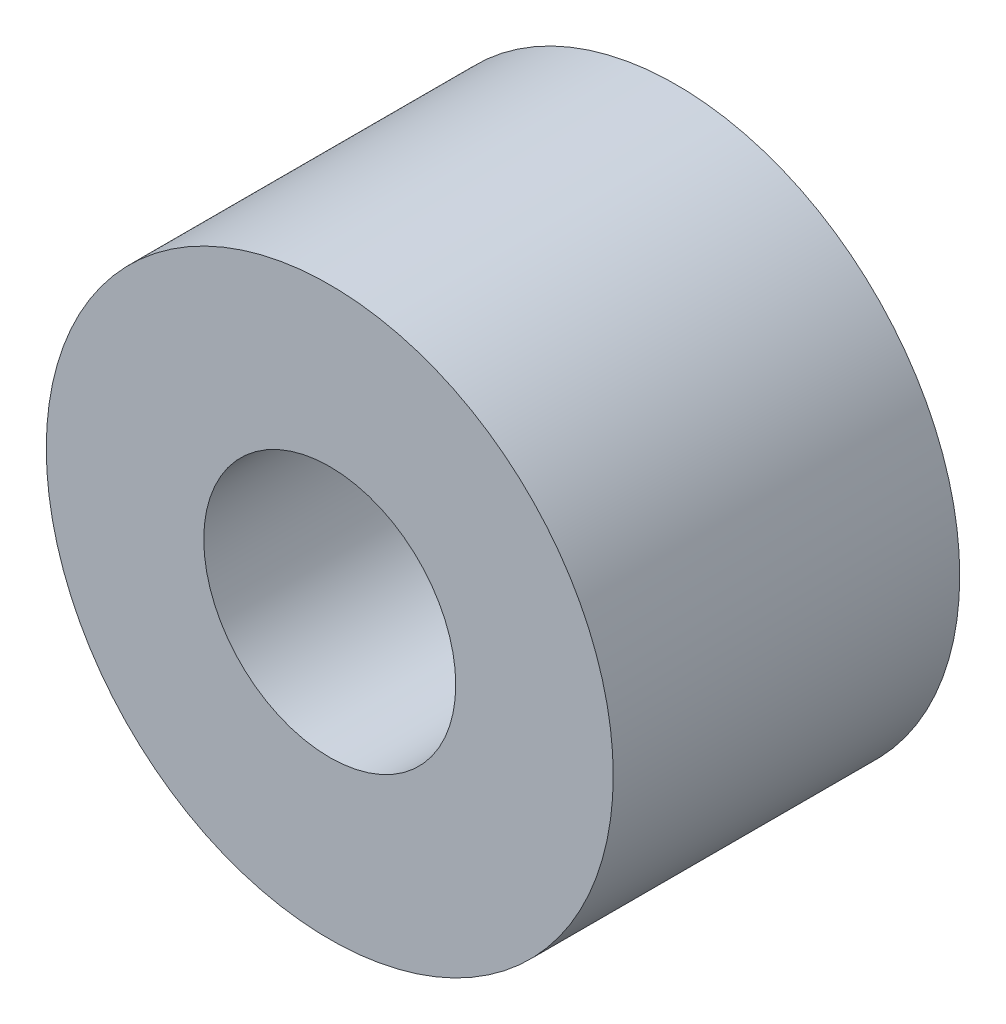
ISO-10303-21;
HEADER;
FILE_DESCRIPTION(('STEP AP214'),'2;1');
FILE_NAME('part.step','',(''),(''),'','','');
FILE_SCHEMA(('AUTOMOTIVE_DESIGN { 1 0 10303 214 1 1 1 1 }'));
ENDSEC;
DATA;
#1=APPLICATION_CONTEXT('core data for automotive mechanical design processes');
#2=APPLICATION_PROTOCOL_DEFINITION('international standard','automotive_design',2000,#1);
#3=PRODUCT_CONTEXT('',#1,'mechanical');
#4=PRODUCT('Part','Part','',(#3));
#5=PRODUCT_RELATED_PRODUCT_CATEGORY('part','',(#4));
#6=PRODUCT_DEFINITION_FORMATION('','',#4);
#7=PRODUCT_DEFINITION_CONTEXT('part definition',#1,'design');
#8=PRODUCT_DEFINITION('design','',#6,#7);
#9=PRODUCT_DEFINITION_SHAPE('','',#8);
#10=(LENGTH_UNIT() NAMED_UNIT(*) SI_UNIT(.MILLI.,.METRE.));
#11=(NAMED_UNIT(*) PLANE_ANGLE_UNIT() SI_UNIT($,.RADIAN.));
#12=(NAMED_UNIT(*) SI_UNIT($,.STERADIAN.) SOLID_ANGLE_UNIT());
#13=UNCERTAINTY_MEASURE_WITH_UNIT(LENGTH_MEASURE(1.E-05),#10,'distance_accuracy_value','');
#14=(GEOMETRIC_REPRESENTATION_CONTEXT(3) GLOBAL_UNCERTAINTY_ASSIGNED_CONTEXT((#13)) GLOBAL_UNIT_ASSIGNED_CONTEXT((#10,
#11,#12)) REPRESENTATION_CONTEXT('',''));
#15=CARTESIAN_POINT('',(0.,0.,0.));
#16=DIRECTION('',(0.,0.,1.));
#17=DIRECTION('',(1.,0.,0.));
#18=AXIS2_PLACEMENT_3D('',#15,#16,#17);
#19=CARTESIAN_POINT('',(0.,0.,5.5));
#20=DIRECTION('',(0.,0.,1.));
#21=DIRECTION('',(1.,0.,0.));
#22=AXIS2_PLACEMENT_3D('',#19,#20,#21);
#23=PLANE('',#22);
#24=CARTESIAN_POINT('',(0.,0.,5.5));
#25=DIRECTION('',(0.,0.,1.));
#26=DIRECTION('',(1.,0.,0.));
#27=AXIS2_PLACEMENT_3D('',#24,#25,#26);
#28=CIRCLE('',#27,4.5);
#29=CARTESIAN_POINT('',(4.5,0.,5.5));
#30=VERTEX_POINT('',#29);
#31=EDGE_CURVE('E10',#30,#30,#28,.T.);
#32=ORIENTED_EDGE('',*,*,#31,.T.);
#33=EDGE_LOOP('',(#32));
#34=FACE_BOUND('',#33,.T.);
#35=CARTESIAN_POINT('',(0.,0.,5.5));
#36=DIRECTION('',(0.,0.,1.));
#37=DIRECTION('',(1.,0.,0.));
#38=AXIS2_PLACEMENT_3D('',#35,#36,#37);
#39=CIRCLE('',#38,2.);
#40=CARTESIAN_POINT('',(2.,0.,5.5));
#41=VERTEX_POINT('',#40);
#42=EDGE_CURVE('E50',#41,#41,#39,.T.);
#43=ORIENTED_EDGE('',*,*,#42,.F.);
#44=EDGE_LOOP('',(#43));
#45=FACE_BOUND('',#44,.T.);
#46=ADVANCED_FACE('F37',(#34,#45),#23,.T.);
#47=CARTESIAN_POINT('',(0.,0.,0.));
#48=DIRECTION('',(0.,0.,1.));
#49=DIRECTION('',(1.,0.,0.));
#50=AXIS2_PLACEMENT_3D('',#47,#48,#49);
#51=PLANE('',#50);
#52=CARTESIAN_POINT('',(0.,0.,0.));
#53=DIRECTION('',(0.,0.,1.));
#54=DIRECTION('',(1.,0.,0.));
#55=AXIS2_PLACEMENT_3D('',#52,#53,#54);
#56=CIRCLE('',#55,4.5);
#57=CARTESIAN_POINT('',(4.5,0.,0.));
#58=VERTEX_POINT('',#57);
#59=EDGE_CURVE('E41',#58,#58,#56,.T.);
#60=ORIENTED_EDGE('',*,*,#59,.F.);
#61=EDGE_LOOP('',(#60));
#62=FACE_BOUND('',#61,.T.);
#63=CARTESIAN_POINT('',(0.,0.,0.));
#64=DIRECTION('',(0.,0.,1.));
#65=DIRECTION('',(1.,0.,0.));
#66=AXIS2_PLACEMENT_3D('',#63,#64,#65);
#67=CIRCLE('',#66,2.);
#68=CARTESIAN_POINT('',(2.,0.,0.));
#69=VERTEX_POINT('',#68);
#70=EDGE_CURVE('E52',#69,#69,#67,.T.);
#71=ORIENTED_EDGE('',*,*,#70,.T.);
#72=EDGE_LOOP('',(#71));
#73=FACE_BOUND('',#72,.T.);
#74=ADVANCED_FACE('F64',(#62,#73),#51,.F.);
#75=CARTESIAN_POINT('',(0.,0.,5.5));
#76=DIRECTION('',(0.,0.,-1.));
#77=DIRECTION('',(-1.,0.,0.));
#78=AXIS2_PLACEMENT_3D('',#75,#76,#77);
#79=CYLINDRICAL_SURFACE('',#78,4.5);
#80=ORIENTED_EDGE('',*,*,#31,.F.);
#81=EDGE_LOOP('',(#80));
#82=FACE_BOUND('',#81,.T.);
#83=ORIENTED_EDGE('',*,*,#59,.T.);
#84=EDGE_LOOP('',(#83));
#85=FACE_BOUND('',#84,.T.);
#86=ADVANCED_FACE('F39',(#82,#85),#79,.T.);
#87=CARTESIAN_POINT('',(0.,0.,5.5));
#88=DIRECTION('',(0.,0.,-1.));
#89=DIRECTION('',(-1.,0.,0.));
#90=AXIS2_PLACEMENT_3D('',#87,#88,#89);
#91=CYLINDRICAL_SURFACE('',#90,2.);
#92=ORIENTED_EDGE('',*,*,#42,.T.);
#93=EDGE_LOOP('',(#92));
#94=FACE_BOUND('',#93,.T.);
#95=ORIENTED_EDGE('',*,*,#70,.F.);
#96=EDGE_LOOP('',(#95));
#97=FACE_BOUND('',#96,.T.);
#98=ADVANCED_FACE('F60',(#94,#97),#91,.F.);
#99=CLOSED_SHELL('',(#46,#74,#86,#98));
#100=MANIFOLD_SOLID_BREP('B2',#99);
#101=ADVANCED_BREP_SHAPE_REPRESENTATION('',(#18,#100),#14);
#102=SHAPE_DEFINITION_REPRESENTATION(#9,#101);
ENDSEC;
END-ISO-10303-21;
